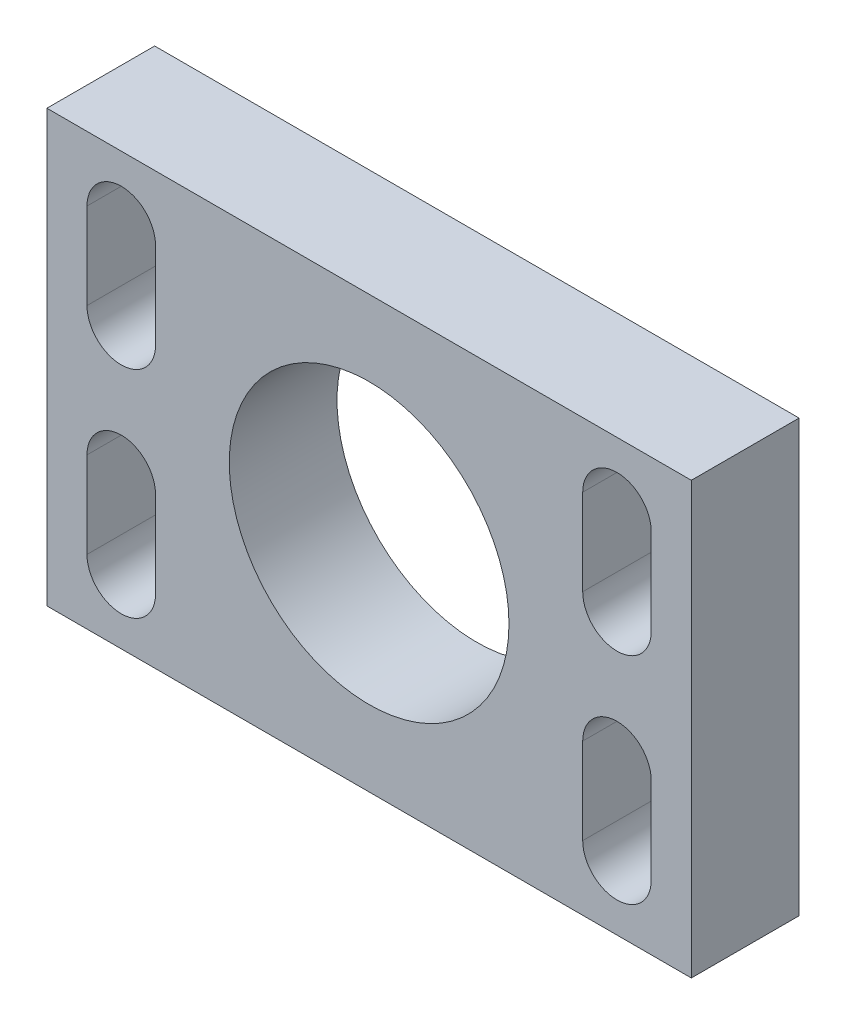
ISO-10303-21;
HEADER;
FILE_DESCRIPTION(('STEP AP214'),'2;1');
FILE_NAME('part.step','',(''),(''),'','','');
FILE_SCHEMA(('AUTOMOTIVE_DESIGN { 1 0 10303 214 1 1 1 1 }'));
ENDSEC;
DATA;
#1=APPLICATION_CONTEXT('core data for automotive mechanical design processes');
#2=APPLICATION_PROTOCOL_DEFINITION('international standard','automotive_design',2000,#1);
#3=PRODUCT_CONTEXT('',#1,'mechanical');
#4=PRODUCT('Part','Part','',(#3));
#5=PRODUCT_RELATED_PRODUCT_CATEGORY('part','',(#4));
#6=PRODUCT_DEFINITION_FORMATION('','',#4);
#7=PRODUCT_DEFINITION_CONTEXT('part definition',#1,'design');
#8=PRODUCT_DEFINITION('design','',#6,#7);
#9=PRODUCT_DEFINITION_SHAPE('','',#8);
#10=(LENGTH_UNIT() NAMED_UNIT(*) SI_UNIT(.MILLI.,.METRE.));
#11=(NAMED_UNIT(*) PLANE_ANGLE_UNIT() SI_UNIT($,.RADIAN.));
#12=(NAMED_UNIT(*) SI_UNIT($,.STERADIAN.) SOLID_ANGLE_UNIT());
#13=UNCERTAINTY_MEASURE_WITH_UNIT(LENGTH_MEASURE(1.E-05),#10,'distance_accuracy_value','');
#14=(GEOMETRIC_REPRESENTATION_CONTEXT(3) GLOBAL_UNCERTAINTY_ASSIGNED_CONTEXT((#13)) GLOBAL_UNIT_ASSIGNED_CONTEXT((#10,
#11,#12)) REPRESENTATION_CONTEXT('',''));
#15=CARTESIAN_POINT('',(0.,0.,0.));
#16=DIRECTION('',(0.,0.,1.));
#17=DIRECTION('',(1.,0.,0.));
#18=AXIS2_PLACEMENT_3D('',#15,#16,#17);
#19=CARTESIAN_POINT('',(-6.22137404580153,20.,1.56488549618321));
#20=DIRECTION('',(0.,0.,-1.));
#21=DIRECTION('',(-1.,0.,0.));
#22=AXIS2_PLACEMENT_3D('',#19,#20,#21);
#23=PLANE('',#22);
#24=CARTESIAN_POINT('',(-2.77137404580153,3.,1.56488549618321));
#25=DIRECTION('',(0.,0.,1.));
#26=DIRECTION('',(1.,0.,0.));
#27=AXIS2_PLACEMENT_3D('',#24,#25,#26);
#28=CIRCLE('',#27,1.59);
#29=CARTESIAN_POINT('',(-1.18137404580153,3.,1.56488549618321));
#30=VERTEX_POINT('',#29);
#31=CARTESIAN_POINT('',(-4.36137404580153,3.,1.56488549618321));
#32=VERTEX_POINT('',#31);
#33=EDGE_CURVE('E194',#30,#32,#28,.F.);
#34=ORIENTED_EDGE('',*,*,#33,.T.);
#35=DIRECTION('',(0.,-1.,0.));
#36=VECTOR('',#35,1.);
#37=CARTESIAN_POINT('',(-4.36137404580153,0.,1.56488549618321));
#38=LINE('',#37,#36);
#39=CARTESIAN_POINT('',(-4.36137404580153,7.,1.56488549618321));
#40=VERTEX_POINT('',#39);
#41=EDGE_CURVE('E195',#40,#32,#38,.T.);
#42=ORIENTED_EDGE('',*,*,#41,.F.);
#43=CARTESIAN_POINT('',(-2.77137404580153,7.,1.56488549618321));
#44=DIRECTION('',(0.,0.,1.));
#45=DIRECTION('',(1.,0.,0.));
#46=AXIS2_PLACEMENT_3D('',#43,#44,#45);
#47=CIRCLE('',#46,1.59);
#48=CARTESIAN_POINT('',(-1.18137404580153,7.,1.56488549618321));
#49=VERTEX_POINT('',#48);
#50=EDGE_CURVE('E209',#40,#49,#47,.F.);
#51=ORIENTED_EDGE('',*,*,#50,.T.);
#52=DIRECTION('',(0.,-1.,0.));
#53=VECTOR('',#52,1.);
#54=CARTESIAN_POINT('',(-1.18137404580153,0.,1.56488549618321));
#55=LINE('',#54,#53);
#56=EDGE_CURVE('E202',#49,#30,#55,.T.);
#57=ORIENTED_EDGE('',*,*,#56,.T.);
#58=EDGE_LOOP('',(#34,#42,#51,#57));
#59=FACE_BOUND('',#58,.T.);
#60=CARTESIAN_POINT('',(-2.77137404580153,17.,1.56488549618321));
#61=DIRECTION('',(0.,0.,1.));
#62=DIRECTION('',(1.,0.,0.));
#63=AXIS2_PLACEMENT_3D('',#60,#61,#62);
#64=CIRCLE('',#63,1.59);
#65=CARTESIAN_POINT('',(-1.18137404580153,17.,1.56488549618321));
#66=VERTEX_POINT('',#65);
#67=CARTESIAN_POINT('',(-4.36137404580153,17.,1.56488549618321));
#68=VERTEX_POINT('',#67);
#69=EDGE_CURVE('E287',#66,#68,#64,.T.);
#70=ORIENTED_EDGE('',*,*,#69,.F.);
#71=DIRECTION('',(0.,1.,0.));
#72=VECTOR('',#71,1.);
#73=CARTESIAN_POINT('',(-1.18137404580153,0.,1.56488549618321));
#74=LINE('',#73,#72);
#75=CARTESIAN_POINT('',(-1.18137404580153,13.,1.56488549618321));
#76=VERTEX_POINT('',#75);
#77=EDGE_CURVE('E285',#76,#66,#74,.T.);
#78=ORIENTED_EDGE('',*,*,#77,.F.);
#79=CARTESIAN_POINT('',(-2.77137404580153,13.,1.56488549618321));
#80=DIRECTION('',(0.,0.,1.));
#81=DIRECTION('',(1.,0.,0.));
#82=AXIS2_PLACEMENT_3D('',#79,#80,#81);
#83=CIRCLE('',#82,1.59);
#84=CARTESIAN_POINT('',(-4.36137404580153,13.,1.56488549618321));
#85=VERTEX_POINT('',#84);
#86=EDGE_CURVE('E293',#85,#76,#83,.T.);
#87=ORIENTED_EDGE('',*,*,#86,.F.);
#88=DIRECTION('',(0.,1.,0.));
#89=VECTOR('',#88,1.);
#90=CARTESIAN_POINT('',(-4.36137404580153,0.,1.56488549618321));
#91=LINE('',#90,#89);
#92=EDGE_CURVE('E290',#85,#68,#91,.T.);
#93=ORIENTED_EDGE('',*,*,#92,.T.);
#94=EDGE_LOOP('',(#70,#78,#87,#93));
#95=FACE_BOUND('',#94,.T.);
#96=CARTESIAN_POINT('',(8.72862595419847,10.,1.56488549618321));
#97=DIRECTION('',(0.,0.,1.));
#98=DIRECTION('',(1.,0.,0.));
#99=AXIS2_PLACEMENT_3D('',#96,#97,#98);
#100=CIRCLE('',#99,6.4897);
#101=CARTESIAN_POINT('',(15.2183259541985,10.,1.56488549618321));
#102=VERTEX_POINT('',#101);
#103=EDGE_CURVE('E308',#102,#102,#100,.T.);
#104=ORIENTED_EDGE('',*,*,#103,.F.);
#105=EDGE_LOOP('',(#104));
#106=FACE_BOUND('',#105,.T.);
#107=DIRECTION('',(1.,0.,0.));
#108=VECTOR('',#107,1.);
#109=CARTESIAN_POINT('',(-6.22137404580153,0.,1.56488549618321));
#110=LINE('',#109,#108);
#111=CARTESIAN_POINT('',(-6.22137404580153,0.,1.56488549618321));
#112=VERTEX_POINT('',#111);
#113=CARTESIAN_POINT('',(23.6786259541985,0.,1.56488549618321));
#114=VERTEX_POINT('',#113);
#115=EDGE_CURVE('E328',#112,#114,#110,.T.);
#116=ORIENTED_EDGE('',*,*,#115,.T.);
#117=DIRECTION('',(0.,-1.,0.));
#118=VECTOR('',#117,1.);
#119=CARTESIAN_POINT('',(23.6786259541985,20.,1.56488549618321));
#120=LINE('',#119,#118);
#121=CARTESIAN_POINT('',(23.6786259541985,20.,1.56488549618321));
#122=VERTEX_POINT('',#121);
#123=EDGE_CURVE('E45',#122,#114,#120,.T.);
#124=ORIENTED_EDGE('',*,*,#123,.F.);
#125=DIRECTION('',(1.,0.,0.));
#126=VECTOR('',#125,1.);
#127=CARTESIAN_POINT('',(-6.22137404580153,20.,1.56488549618321));
#128=LINE('',#127,#126);
#129=CARTESIAN_POINT('',(-6.22137404580153,20.,1.56488549618321));
#130=VERTEX_POINT('',#129);
#131=EDGE_CURVE('E318',#130,#122,#128,.T.);
#132=ORIENTED_EDGE('',*,*,#131,.F.);
#133=DIRECTION('',(0.,-1.,0.));
#134=VECTOR('',#133,1.);
#135=CARTESIAN_POINT('',(-6.22137404580153,20.,1.56488549618321));
#136=LINE('',#135,#134);
#137=EDGE_CURVE('E11',#130,#112,#136,.T.);
#138=ORIENTED_EDGE('',*,*,#137,.T.);
#139=EDGE_LOOP('',(#116,#124,#132,#138));
#140=FACE_BOUND('',#139,.T.);
#141=CARTESIAN_POINT('',(20.2286259541985,3.,1.56488549618321));
#142=DIRECTION('',(0.,0.,1.));
#143=DIRECTION('',(1.,0.,0.));
#144=AXIS2_PLACEMENT_3D('',#141,#142,#143);
#145=CIRCLE('',#144,1.59);
#146=CARTESIAN_POINT('',(18.6386259541985,3.,1.56488549618321));
#147=VERTEX_POINT('',#146);
#148=CARTESIAN_POINT('',(21.8186259541985,3.,1.56488549618321));
#149=VERTEX_POINT('',#148);
#150=EDGE_CURVE('E229',#147,#149,#145,.T.);
#151=ORIENTED_EDGE('',*,*,#150,.F.);
#152=DIRECTION('',(0.,-1.,0.));
#153=VECTOR('',#152,1.);
#154=CARTESIAN_POINT('',(18.6386259541985,0.,1.56488549618321));
#155=LINE('',#154,#153);
#156=CARTESIAN_POINT('',(18.6386259541985,7.,1.56488549618321));
#157=VERTEX_POINT('',#156);
#158=EDGE_CURVE('E60',#157,#147,#155,.T.);
#159=ORIENTED_EDGE('',*,*,#158,.F.);
#160=CARTESIAN_POINT('',(20.2286259541985,7.,1.56488549618321));
#161=DIRECTION('',(0.,0.,1.));
#162=DIRECTION('',(1.,0.,0.));
#163=AXIS2_PLACEMENT_3D('',#160,#161,#162);
#164=CIRCLE('',#163,1.59);
#165=CARTESIAN_POINT('',(21.8186259541985,7.,1.56488549618321));
#166=VERTEX_POINT('',#165);
#167=EDGE_CURVE('E235',#166,#157,#164,.T.);
#168=ORIENTED_EDGE('',*,*,#167,.F.);
#169=DIRECTION('',(0.,-1.,0.));
#170=VECTOR('',#169,1.);
#171=CARTESIAN_POINT('',(21.8186259541985,0.,1.56488549618321));
#172=LINE('',#171,#170);
#173=EDGE_CURVE('E232',#166,#149,#172,.T.);
#174=ORIENTED_EDGE('',*,*,#173,.T.);
#175=EDGE_LOOP('',(#151,#159,#168,#174));
#176=FACE_BOUND('',#175,.T.);
#177=CARTESIAN_POINT('',(20.2286259541985,17.,1.56488549618321));
#178=DIRECTION('',(0.,0.,1.));
#179=DIRECTION('',(1.,0.,0.));
#180=AXIS2_PLACEMENT_3D('',#177,#178,#179);
#181=CIRCLE('',#180,1.59);
#182=CARTESIAN_POINT('',(18.6386259541985,17.,1.56488549618321));
#183=VERTEX_POINT('',#182);
#184=CARTESIAN_POINT('',(21.8186259541985,17.,1.56488549618321));
#185=VERTEX_POINT('',#184);
#186=EDGE_CURVE('E52',#183,#185,#181,.F.);
#187=ORIENTED_EDGE('',*,*,#186,.T.);
#188=DIRECTION('',(0.,1.,0.));
#189=VECTOR('',#188,1.);
#190=CARTESIAN_POINT('',(21.8186259541985,0.,1.56488549618321));
#191=LINE('',#190,#189);
#192=CARTESIAN_POINT('',(21.8186259541985,13.,1.56488549618321));
#193=VERTEX_POINT('',#192);
#194=EDGE_CURVE('E264',#193,#185,#191,.T.);
#195=ORIENTED_EDGE('',*,*,#194,.F.);
#196=CARTESIAN_POINT('',(20.2286259541985,13.,1.56488549618321));
#197=DIRECTION('',(0.,0.,1.));
#198=DIRECTION('',(1.,0.,0.));
#199=AXIS2_PLACEMENT_3D('',#196,#197,#198);
#200=CIRCLE('',#199,1.59);
#201=CARTESIAN_POINT('',(18.6386259541985,13.,1.56488549618321));
#202=VERTEX_POINT('',#201);
#203=EDGE_CURVE('E261',#193,#202,#200,.F.);
#204=ORIENTED_EDGE('',*,*,#203,.T.);
#205=DIRECTION('',(0.,1.,0.));
#206=VECTOR('',#205,1.);
#207=CARTESIAN_POINT('',(18.6386259541985,0.,1.56488549618321));
#208=LINE('',#207,#206);
#209=EDGE_CURVE('E258',#202,#183,#208,.T.);
#210=ORIENTED_EDGE('',*,*,#209,.T.);
#211=EDGE_LOOP('',(#187,#195,#204,#210));
#212=FACE_BOUND('',#211,.T.);
#213=ADVANCED_FACE('F37',(#59,#95,#106,#140,#176,#212),#23,.F.);
#214=CARTESIAN_POINT('',(-6.22137404580153,20.,-3.43511450381679));
#215=DIRECTION('',(0.,0.,1.));
#216=DIRECTION('',(1.,0.,0.));
#217=AXIS2_PLACEMENT_3D('',#214,#215,#216);
#218=PLANE('',#217);
#219=CARTESIAN_POINT('',(-2.77137404580153,3.,-3.43511450381679));
#220=DIRECTION('',(0.,0.,1.));
#221=DIRECTION('',(1.,0.,0.));
#222=AXIS2_PLACEMENT_3D('',#219,#220,#221);
#223=CIRCLE('',#222,1.59);
#224=CARTESIAN_POINT('',(-4.36137404580153,3.,-3.43511450381679));
#225=VERTEX_POINT('',#224);
#226=CARTESIAN_POINT('',(-1.18137404580153,3.,-3.43511450381679));
#227=VERTEX_POINT('',#226);
#228=EDGE_CURVE('E191',#225,#227,#223,.T.);
#229=ORIENTED_EDGE('',*,*,#228,.T.);
#230=DIRECTION('',(0.,1.,0.));
#231=VECTOR('',#230,1.);
#232=CARTESIAN_POINT('',(-1.18137404580153,0.,-3.43511450381679));
#233=LINE('',#232,#231);
#234=CARTESIAN_POINT('',(-1.18137404580153,7.,-3.43511450381679));
#235=VERTEX_POINT('',#234);
#236=EDGE_CURVE('E175',#227,#235,#233,.T.);
#237=ORIENTED_EDGE('',*,*,#236,.T.);
#238=CARTESIAN_POINT('',(-2.77137404580153,7.,-3.43511450381679));
#239=DIRECTION('',(0.,0.,1.));
#240=DIRECTION('',(1.,0.,0.));
#241=AXIS2_PLACEMENT_3D('',#238,#239,#240);
#242=CIRCLE('',#241,1.59);
#243=CARTESIAN_POINT('',(-4.36137404580154,7.,-3.43511450381679));
#244=VERTEX_POINT('',#243);
#245=EDGE_CURVE('E204',#235,#244,#242,.T.);
#246=ORIENTED_EDGE('',*,*,#245,.T.);
#247=DIRECTION('',(0.,1.,0.));
#248=VECTOR('',#247,1.);
#249=CARTESIAN_POINT('',(-4.36137404580153,0.,-3.43511450381679));
#250=LINE('',#249,#248);
#251=EDGE_CURVE('E200',#225,#244,#250,.T.);
#252=ORIENTED_EDGE('',*,*,#251,.F.);
#253=EDGE_LOOP('',(#229,#237,#246,#252));
#254=FACE_BOUND('',#253,.T.);
#255=CARTESIAN_POINT('',(-2.77137404580153,13.,-3.43511450381679));
#256=DIRECTION('',(0.,0.,1.));
#257=DIRECTION('',(1.,0.,0.));
#258=AXIS2_PLACEMENT_3D('',#255,#256,#257);
#259=CIRCLE('',#258,1.59);
#260=CARTESIAN_POINT('',(-1.18137404580153,13.,-3.43511450381679));
#261=VERTEX_POINT('',#260);
#262=CARTESIAN_POINT('',(-4.36137404580153,13.,-3.43511450381679));
#263=VERTEX_POINT('',#262);
#264=EDGE_CURVE('E279',#261,#263,#259,.F.);
#265=ORIENTED_EDGE('',*,*,#264,.F.);
#266=DIRECTION('',(0.,-1.,0.));
#267=VECTOR('',#266,1.);
#268=CARTESIAN_POINT('',(-1.18137404580153,0.,-3.43511450381679));
#269=LINE('',#268,#267);
#270=CARTESIAN_POINT('',(-1.18137404580153,17.,-3.43511450381679));
#271=VERTEX_POINT('',#270);
#272=EDGE_CURVE('E282',#271,#261,#269,.T.);
#273=ORIENTED_EDGE('',*,*,#272,.F.);
#274=CARTESIAN_POINT('',(-2.77137404580153,17.,-3.43511450381679));
#275=DIRECTION('',(0.,0.,1.));
#276=DIRECTION('',(1.,0.,0.));
#277=AXIS2_PLACEMENT_3D('',#274,#275,#276);
#278=CIRCLE('',#277,1.59);
#279=CARTESIAN_POINT('',(-4.36137404580154,17.,-3.43511450381679));
#280=VERTEX_POINT('',#279);
#281=EDGE_CURVE('E299',#280,#271,#278,.F.);
#282=ORIENTED_EDGE('',*,*,#281,.F.);
#283=DIRECTION('',(0.,-1.,0.));
#284=VECTOR('',#283,1.);
#285=CARTESIAN_POINT('',(-4.36137404580153,0.,-3.43511450381679));
#286=LINE('',#285,#284);
#287=EDGE_CURVE('E186',#280,#263,#286,.T.);
#288=ORIENTED_EDGE('',*,*,#287,.T.);
#289=EDGE_LOOP('',(#265,#273,#282,#288));
#290=FACE_BOUND('',#289,.T.);
#291=CARTESIAN_POINT('',(8.72862595419847,10.,-3.43511450381679));
#292=DIRECTION('',(0.,0.,1.));
#293=DIRECTION('',(1.,0.,0.));
#294=AXIS2_PLACEMENT_3D('',#291,#292,#293);
#295=CIRCLE('',#294,6.4897);
#296=CARTESIAN_POINT('',(15.2183259541985,10.,-3.43511450381679));
#297=VERTEX_POINT('',#296);
#298=EDGE_CURVE('E311',#297,#297,#295,.F.);
#299=ORIENTED_EDGE('',*,*,#298,.F.);
#300=EDGE_LOOP('',(#299));
#301=FACE_BOUND('',#300,.T.);
#302=DIRECTION('',(-1.,0.,0.));
#303=VECTOR('',#302,1.);
#304=CARTESIAN_POINT('',(-6.22137404580153,0.,-3.43511450381679));
#305=LINE('',#304,#303);
#306=CARTESIAN_POINT('',(23.6786259541985,0.,-3.43511450381679));
#307=VERTEX_POINT('',#306);
#308=CARTESIAN_POINT('',(-6.22137404580153,0.,-3.43511450381679));
#309=VERTEX_POINT('',#308);
#310=EDGE_CURVE('E319',#307,#309,#305,.T.);
#311=ORIENTED_EDGE('',*,*,#310,.T.);
#312=DIRECTION('',(0.,-1.,0.));
#313=VECTOR('',#312,1.);
#314=CARTESIAN_POINT('',(-6.22137404580153,20.,-3.43511450381679));
#315=LINE('',#314,#313);
#316=CARTESIAN_POINT('',(-6.22137404580153,20.,-3.43511450381679));
#317=VERTEX_POINT('',#316);
#318=EDGE_CURVE('E325',#317,#309,#315,.T.);
#319=ORIENTED_EDGE('',*,*,#318,.F.);
#320=DIRECTION('',(-1.,0.,0.));
#321=VECTOR('',#320,1.);
#322=CARTESIAN_POINT('',(-6.22137404580153,20.,-3.43511450381679));
#323=LINE('',#322,#321);
#324=CARTESIAN_POINT('',(23.6786259541985,20.,-3.43511450381679));
#325=VERTEX_POINT('',#324);
#326=EDGE_CURVE('E323',#325,#317,#323,.T.);
#327=ORIENTED_EDGE('',*,*,#326,.F.);
#328=DIRECTION('',(0.,-1.,0.));
#329=VECTOR('',#328,1.);
#330=CARTESIAN_POINT('',(23.6786259541985,20.,-3.43511450381679));
#331=LINE('',#330,#329);
#332=EDGE_CURVE('E335',#325,#307,#331,.T.);
#333=ORIENTED_EDGE('',*,*,#332,.T.);
#334=EDGE_LOOP('',(#311,#319,#327,#333));
#335=FACE_BOUND('',#334,.T.);
#336=CARTESIAN_POINT('',(20.2286259541985,7.,-3.43511450381679));
#337=DIRECTION('',(0.,0.,1.));
#338=DIRECTION('',(1.,0.,0.));
#339=AXIS2_PLACEMENT_3D('',#336,#337,#338);
#340=CIRCLE('',#339,1.59);
#341=CARTESIAN_POINT('',(18.6386259541985,7.,-3.43511450381679));
#342=VERTEX_POINT('',#341);
#343=CARTESIAN_POINT('',(21.8186259541985,7.,-3.43511450381679));
#344=VERTEX_POINT('',#343);
#345=EDGE_CURVE('E221',#342,#344,#340,.F.);
#346=ORIENTED_EDGE('',*,*,#345,.F.);
#347=DIRECTION('',(0.,1.,0.));
#348=VECTOR('',#347,1.);
#349=CARTESIAN_POINT('',(18.6386259541985,0.,-3.43511450381679));
#350=LINE('',#349,#348);
#351=CARTESIAN_POINT('',(18.6386259541985,3.,-3.43511450381679));
#352=VERTEX_POINT('',#351);
#353=EDGE_CURVE('E225',#352,#342,#350,.T.);
#354=ORIENTED_EDGE('',*,*,#353,.F.);
#355=CARTESIAN_POINT('',(20.2286259541985,3.,-3.43511450381679));
#356=DIRECTION('',(0.,0.,1.));
#357=DIRECTION('',(1.,0.,0.));
#358=AXIS2_PLACEMENT_3D('',#355,#356,#357);
#359=CIRCLE('',#358,1.59);
#360=CARTESIAN_POINT('',(21.8186259541985,3.,-3.43511450381679));
#361=VERTEX_POINT('',#360);
#362=EDGE_CURVE('E241',#361,#352,#359,.F.);
#363=ORIENTED_EDGE('',*,*,#362,.F.);
#364=DIRECTION('',(0.,1.,0.));
#365=VECTOR('',#364,1.);
#366=CARTESIAN_POINT('',(21.8186259541985,0.,-3.43511450381679));
#367=LINE('',#366,#365);
#368=EDGE_CURVE('E218',#361,#344,#367,.T.);
#369=ORIENTED_EDGE('',*,*,#368,.T.);
#370=EDGE_LOOP('',(#346,#354,#363,#369));
#371=FACE_BOUND('',#370,.T.);
#372=CARTESIAN_POINT('',(20.2286259541985,17.,-3.43511450381679));
#373=DIRECTION('',(0.,0.,1.));
#374=DIRECTION('',(1.,0.,0.));
#375=AXIS2_PLACEMENT_3D('',#372,#373,#374);
#376=CIRCLE('',#375,1.59);
#377=CARTESIAN_POINT('',(21.8186259541985,17.,-3.43511450381679));
#378=VERTEX_POINT('',#377);
#379=CARTESIAN_POINT('',(18.6386259541985,17.,-3.43511450381679));
#380=VERTEX_POINT('',#379);
#381=EDGE_CURVE('E254',#378,#380,#376,.T.);
#382=ORIENTED_EDGE('',*,*,#381,.T.);
#383=DIRECTION('',(0.,-1.,0.));
#384=VECTOR('',#383,1.);
#385=CARTESIAN_POINT('',(18.6386259541985,0.,-3.43511450381679));
#386=LINE('',#385,#384);
#387=CARTESIAN_POINT('',(18.6386259541985,13.,-3.43511450381679));
#388=VERTEX_POINT('',#387);
#389=EDGE_CURVE('E222',#380,#388,#386,.T.);
#390=ORIENTED_EDGE('',*,*,#389,.T.);
#391=CARTESIAN_POINT('',(20.2286259541985,13.,-3.43511450381679));
#392=DIRECTION('',(0.,0.,1.));
#393=DIRECTION('',(1.,0.,0.));
#394=AXIS2_PLACEMENT_3D('',#391,#392,#393);
#395=CIRCLE('',#394,1.59);
#396=CARTESIAN_POINT('',(21.8186259541985,13.,-3.43511450381679));
#397=VERTEX_POINT('',#396);
#398=EDGE_CURVE('E249',#388,#397,#395,.T.);
#399=ORIENTED_EDGE('',*,*,#398,.T.);
#400=DIRECTION('',(0.,-1.,0.));
#401=VECTOR('',#400,1.);
#402=CARTESIAN_POINT('',(21.8186259541985,0.,-3.43511450381679));
#403=LINE('',#402,#401);
#404=EDGE_CURVE('E252',#378,#397,#403,.T.);
#405=ORIENTED_EDGE('',*,*,#404,.F.);
#406=EDGE_LOOP('',(#382,#390,#399,#405));
#407=FACE_BOUND('',#406,.T.);
#408=ADVANCED_FACE('F198',(#254,#290,#301,#335,#371,#407),#218,.F.);
#409=CARTESIAN_POINT('',(-6.22137404580153,20.,-3.43511450381679));
#410=DIRECTION('',(1.,0.,0.));
#411=DIRECTION('',(0.,0.,-1.));
#412=AXIS2_PLACEMENT_3D('',#409,#410,#411);
#413=PLANE('',#412);
#414=DIRECTION('',(0.,0.,1.));
#415=VECTOR('',#414,1.);
#416=CARTESIAN_POINT('',(-6.22137404580153,0.,-3.43511450381679));
#417=LINE('',#416,#415);
#418=EDGE_CURVE('E314',#309,#112,#417,.T.);
#419=ORIENTED_EDGE('',*,*,#418,.T.);
#420=ORIENTED_EDGE('',*,*,#137,.F.);
#421=DIRECTION('',(0.,0.,1.));
#422=VECTOR('',#421,1.);
#423=CARTESIAN_POINT('',(-6.22137404580153,20.,-3.43511450381679));
#424=LINE('',#423,#422);
#425=EDGE_CURVE('E315',#317,#130,#424,.T.);
#426=ORIENTED_EDGE('',*,*,#425,.F.);
#427=ORIENTED_EDGE('',*,*,#318,.T.);
#428=EDGE_LOOP('',(#419,#420,#426,#427));
#429=FACE_BOUND('',#428,.T.);
#430=ADVANCED_FACE('F39',(#429),#413,.F.);
#431=CARTESIAN_POINT('',(23.6786259541985,20.,-3.43511450381679));
#432=DIRECTION('',(-1.,0.,0.));
#433=DIRECTION('',(0.,0.,1.));
#434=AXIS2_PLACEMENT_3D('',#431,#432,#433);
#435=PLANE('',#434);
#436=DIRECTION('',(0.,0.,-1.));
#437=VECTOR('',#436,1.);
#438=CARTESIAN_POINT('',(23.6786259541985,0.,-3.43511450381679));
#439=LINE('',#438,#437);
#440=EDGE_CURVE('E330',#114,#307,#439,.T.);
#441=ORIENTED_EDGE('',*,*,#440,.T.);
#442=ORIENTED_EDGE('',*,*,#332,.F.);
#443=DIRECTION('',(0.,0.,-1.));
#444=VECTOR('',#443,1.);
#445=CARTESIAN_POINT('',(23.6786259541985,20.,-3.43511450381679));
#446=LINE('',#445,#444);
#447=EDGE_CURVE('E321',#122,#325,#446,.T.);
#448=ORIENTED_EDGE('',*,*,#447,.F.);
#449=ORIENTED_EDGE('',*,*,#123,.T.);
#450=EDGE_LOOP('',(#441,#442,#448,#449));
#451=FACE_BOUND('',#450,.T.);
#452=ADVANCED_FACE('F342',(#451),#435,.F.);
#453=CARTESIAN_POINT('',(0.,20.,0.));
#454=DIRECTION('',(0.,1.,0.));
#455=DIRECTION('',(0.,0.,1.));
#456=AXIS2_PLACEMENT_3D('',#453,#454,#455);
#457=PLANE('',#456);
#458=ORIENTED_EDGE('',*,*,#425,.T.);
#459=ORIENTED_EDGE('',*,*,#131,.T.);
#460=ORIENTED_EDGE('',*,*,#447,.T.);
#461=ORIENTED_EDGE('',*,*,#326,.T.);
#462=EDGE_LOOP('',(#458,#459,#460,#461));
#463=FACE_BOUND('',#462,.T.);
#464=ADVANCED_FACE('F357',(#463),#457,.T.);
#465=CARTESIAN_POINT('',(0.,0.,0.));
#466=DIRECTION('',(0.,1.,0.));
#467=DIRECTION('',(0.,0.,1.));
#468=AXIS2_PLACEMENT_3D('',#465,#466,#467);
#469=PLANE('',#468);
#470=ORIENTED_EDGE('',*,*,#418,.F.);
#471=ORIENTED_EDGE('',*,*,#310,.F.);
#472=ORIENTED_EDGE('',*,*,#440,.F.);
#473=ORIENTED_EDGE('',*,*,#115,.F.);
#474=EDGE_LOOP('',(#470,#471,#472,#473));
#475=FACE_BOUND('',#474,.T.);
#476=ADVANCED_FACE('F348',(#475),#469,.F.);
#477=CARTESIAN_POINT('',(8.72862595419847,10.,-3.43611450381679));
#478=DIRECTION('',(0.,0.,1.));
#479=DIRECTION('',(1.,0.,0.));
#480=AXIS2_PLACEMENT_3D('',#477,#478,#479);
#481=CYLINDRICAL_SURFACE('',#480,6.4897);
#482=ORIENTED_EDGE('',*,*,#103,.T.);
#483=EDGE_LOOP('',(#482));
#484=FACE_BOUND('',#483,.T.);
#485=ORIENTED_EDGE('',*,*,#298,.T.);
#486=EDGE_LOOP('',(#485));
#487=FACE_BOUND('',#486,.T.);
#488=ADVANCED_FACE('F406',(#484,#487),#481,.F.);
#489=CARTESIAN_POINT('',(-1.18137404580153,0.,-3.43611450381679));
#490=DIRECTION('',(1.,0.,0.));
#491=DIRECTION('',(0.,0.,-1.));
#492=AXIS2_PLACEMENT_3D('',#489,#490,#491);
#493=PLANE('',#492);
#494=ORIENTED_EDGE('',*,*,#272,.T.);
#495=DIRECTION('',(0.,0.,1.));
#496=VECTOR('',#495,1.);
#497=CARTESIAN_POINT('',(-1.18137404580153,13.,-3.43611450381679));
#498=LINE('',#497,#496);
#499=EDGE_CURVE('E297',#261,#76,#498,.T.);
#500=ORIENTED_EDGE('',*,*,#499,.T.);
#501=ORIENTED_EDGE('',*,*,#77,.T.);
#502=DIRECTION('',(0.,0.,1.));
#503=VECTOR('',#502,1.);
#504=CARTESIAN_POINT('',(-1.18137404580153,17.,-3.43611450381679));
#505=LINE('',#504,#503);
#506=EDGE_CURVE('E296',#271,#66,#505,.T.);
#507=ORIENTED_EDGE('',*,*,#506,.F.);
#508=EDGE_LOOP('',(#494,#500,#501,#507));
#509=FACE_BOUND('',#508,.T.);
#510=ADVANCED_FACE('F395',(#509),#493,.F.);
#511=CARTESIAN_POINT('',(-2.77137404580153,13.,-3.43611450381679));
#512=DIRECTION('',(0.,0.,1.));
#513=DIRECTION('',(1.,0.,0.));
#514=AXIS2_PLACEMENT_3D('',#511,#512,#513);
#515=CYLINDRICAL_SURFACE('',#514,1.59);
#516=ORIENTED_EDGE('',*,*,#264,.T.);
#517=DIRECTION('',(0.,0.,1.));
#518=VECTOR('',#517,1.);
#519=CARTESIAN_POINT('',(-4.36137404580153,13.,-3.43611450381679));
#520=LINE('',#519,#518);
#521=EDGE_CURVE('E300',#263,#85,#520,.T.);
#522=ORIENTED_EDGE('',*,*,#521,.T.);
#523=ORIENTED_EDGE('',*,*,#86,.T.);
#524=ORIENTED_EDGE('',*,*,#499,.F.);
#525=EDGE_LOOP('',(#516,#522,#523,#524));
#526=FACE_BOUND('',#525,.T.);
#527=ADVANCED_FACE('F391',(#526),#515,.F.);
#528=CARTESIAN_POINT('',(-4.36137404580153,0.,-3.43611450381679));
#529=DIRECTION('',(1.,0.,0.));
#530=DIRECTION('',(0.,0.,-1.));
#531=AXIS2_PLACEMENT_3D('',#528,#529,#530);
#532=PLANE('',#531);
#533=DIRECTION('',(0.,0.,1.));
#534=VECTOR('',#533,1.);
#535=CARTESIAN_POINT('',(-4.36137404580153,17.,-3.43611450381679));
#536=LINE('',#535,#534);
#537=EDGE_CURVE('E302',#280,#68,#536,.T.);
#538=ORIENTED_EDGE('',*,*,#537,.T.);
#539=ORIENTED_EDGE('',*,*,#92,.F.);
#540=ORIENTED_EDGE('',*,*,#521,.F.);
#541=ORIENTED_EDGE('',*,*,#287,.F.);
#542=EDGE_LOOP('',(#538,#539,#540,#541));
#543=FACE_BOUND('',#542,.T.);
#544=ADVANCED_FACE('F394',(#543),#532,.T.);
#545=CARTESIAN_POINT('',(-2.77137404580153,17.,-3.43611450381679));
#546=DIRECTION('',(0.,0.,1.));
#547=DIRECTION('',(1.,0.,0.));
#548=AXIS2_PLACEMENT_3D('',#545,#546,#547);
#549=CYLINDRICAL_SURFACE('',#548,1.59);
#550=ORIENTED_EDGE('',*,*,#281,.T.);
#551=ORIENTED_EDGE('',*,*,#506,.T.);
#552=ORIENTED_EDGE('',*,*,#69,.T.);
#553=ORIENTED_EDGE('',*,*,#537,.F.);
#554=EDGE_LOOP('',(#550,#551,#552,#553));
#555=FACE_BOUND('',#554,.T.);
#556=ADVANCED_FACE('F399',(#555),#549,.F.);
#557=CARTESIAN_POINT('',(-2.77137404580153,3.,-3.43611450381679));
#558=DIRECTION('',(0.,0.,1.));
#559=DIRECTION('',(1.,0.,0.));
#560=AXIS2_PLACEMENT_3D('',#557,#558,#559);
#561=CYLINDRICAL_SURFACE('',#560,1.59);
#562=DIRECTION('',(0.,0.,1.));
#563=VECTOR('',#562,1.);
#564=CARTESIAN_POINT('',(-4.36137404580153,3.,-3.43611450381679));
#565=LINE('',#564,#563);
#566=EDGE_CURVE('E187',#225,#32,#565,.T.);
#567=ORIENTED_EDGE('',*,*,#566,.T.);
#568=ORIENTED_EDGE('',*,*,#33,.F.);
#569=DIRECTION('',(0.,0.,1.));
#570=VECTOR('',#569,1.);
#571=CARTESIAN_POINT('',(-1.18137404580153,3.,-3.43611450381679));
#572=LINE('',#571,#570);
#573=EDGE_CURVE('E179',#227,#30,#572,.T.);
#574=ORIENTED_EDGE('',*,*,#573,.F.);
#575=ORIENTED_EDGE('',*,*,#228,.F.);
#576=EDGE_LOOP('',(#567,#568,#574,#575));
#577=FACE_BOUND('',#576,.T.);
#578=ADVANCED_FACE('F190',(#577),#561,.F.);
#579=CARTESIAN_POINT('',(-4.36137404580153,0.,-3.43611450381679));
#580=DIRECTION('',(-1.,0.,0.));
#581=DIRECTION('',(0.,0.,1.));
#582=AXIS2_PLACEMENT_3D('',#579,#580,#581);
#583=PLANE('',#582);
#584=ORIENTED_EDGE('',*,*,#251,.T.);
#585=DIRECTION('',(0.,0.,1.));
#586=VECTOR('',#585,1.);
#587=CARTESIAN_POINT('',(-4.36137404580153,7.,-3.43611450381679));
#588=LINE('',#587,#586);
#589=EDGE_CURVE('E215',#244,#40,#588,.T.);
#590=ORIENTED_EDGE('',*,*,#589,.T.);
#591=ORIENTED_EDGE('',*,*,#41,.T.);
#592=ORIENTED_EDGE('',*,*,#566,.F.);
#593=EDGE_LOOP('',(#584,#590,#591,#592));
#594=FACE_BOUND('',#593,.T.);
#595=ADVANCED_FACE('F479',(#594),#583,.F.);
#596=CARTESIAN_POINT('',(-2.77137404580153,7.,-3.43611450381679));
#597=DIRECTION('',(0.,0.,1.));
#598=DIRECTION('',(1.,0.,0.));
#599=AXIS2_PLACEMENT_3D('',#596,#597,#598);
#600=CYLINDRICAL_SURFACE('',#599,1.59);
#601=DIRECTION('',(0.,0.,1.));
#602=VECTOR('',#601,1.);
#603=CARTESIAN_POINT('',(-1.18137404580153,7.,-3.43611450381679));
#604=LINE('',#603,#602);
#605=EDGE_CURVE('E181',#235,#49,#604,.T.);
#606=ORIENTED_EDGE('',*,*,#605,.T.);
#607=ORIENTED_EDGE('',*,*,#50,.F.);
#608=ORIENTED_EDGE('',*,*,#589,.F.);
#609=ORIENTED_EDGE('',*,*,#245,.F.);
#610=EDGE_LOOP('',(#606,#607,#608,#609));
#611=FACE_BOUND('',#610,.T.);
#612=ADVANCED_FACE('F486',(#611),#600,.F.);
#613=CARTESIAN_POINT('',(-1.18137404580153,0.,-3.43611450381679));
#614=DIRECTION('',(-1.,0.,0.));
#615=DIRECTION('',(0.,0.,1.));
#616=AXIS2_PLACEMENT_3D('',#613,#614,#615);
#617=PLANE('',#616);
#618=ORIENTED_EDGE('',*,*,#573,.T.);
#619=ORIENTED_EDGE('',*,*,#56,.F.);
#620=ORIENTED_EDGE('',*,*,#605,.F.);
#621=ORIENTED_EDGE('',*,*,#236,.F.);
#622=EDGE_LOOP('',(#618,#619,#620,#621));
#623=FACE_BOUND('',#622,.T.);
#624=ADVANCED_FACE('F177',(#623),#617,.T.);
#625=CARTESIAN_POINT('',(18.6386259541985,0.,-3.43611450381679));
#626=DIRECTION('',(-1.,0.,0.));
#627=DIRECTION('',(0.,0.,1.));
#628=AXIS2_PLACEMENT_3D('',#625,#626,#627);
#629=PLANE('',#628);
#630=ORIENTED_EDGE('',*,*,#353,.T.);
#631=DIRECTION('',(0.,0.,1.));
#632=VECTOR('',#631,1.);
#633=CARTESIAN_POINT('',(18.6386259541985,7.,-3.43611450381679));
#634=LINE('',#633,#632);
#635=EDGE_CURVE('E239',#342,#157,#634,.T.);
#636=ORIENTED_EDGE('',*,*,#635,.T.);
#637=ORIENTED_EDGE('',*,*,#158,.T.);
#638=DIRECTION('',(0.,0.,1.));
#639=VECTOR('',#638,1.);
#640=CARTESIAN_POINT('',(18.6386259541985,3.,-3.43611450381679));
#641=LINE('',#640,#639);
#642=EDGE_CURVE('E238',#352,#147,#641,.T.);
#643=ORIENTED_EDGE('',*,*,#642,.F.);
#644=EDGE_LOOP('',(#630,#636,#637,#643));
#645=FACE_BOUND('',#644,.T.);
#646=ADVANCED_FACE('F501',(#645),#629,.F.);
#647=CARTESIAN_POINT('',(20.2286259541985,7.,-3.43611450381679));
#648=DIRECTION('',(0.,0.,1.));
#649=DIRECTION('',(1.,0.,0.));
#650=AXIS2_PLACEMENT_3D('',#647,#648,#649);
#651=CYLINDRICAL_SURFACE('',#650,1.59);
#652=ORIENTED_EDGE('',*,*,#345,.T.);
#653=DIRECTION('',(0.,0.,1.));
#654=VECTOR('',#653,1.);
#655=CARTESIAN_POINT('',(21.8186259541985,7.,-3.43611450381679));
#656=LINE('',#655,#654);
#657=EDGE_CURVE('E242',#344,#166,#656,.T.);
#658=ORIENTED_EDGE('',*,*,#657,.T.);
#659=ORIENTED_EDGE('',*,*,#167,.T.);
#660=ORIENTED_EDGE('',*,*,#635,.F.);
#661=EDGE_LOOP('',(#652,#658,#659,#660));
#662=FACE_BOUND('',#661,.T.);
#663=ADVANCED_FACE('F508',(#662),#651,.F.);
#664=CARTESIAN_POINT('',(21.8186259541985,0.,-3.43611450381679));
#665=DIRECTION('',(-1.,0.,0.));
#666=DIRECTION('',(0.,0.,1.));
#667=AXIS2_PLACEMENT_3D('',#664,#665,#666);
#668=PLANE('',#667);
#669=DIRECTION('',(0.,0.,1.));
#670=VECTOR('',#669,1.);
#671=CARTESIAN_POINT('',(21.8186259541985,3.,-3.43611450381679));
#672=LINE('',#671,#670);
#673=EDGE_CURVE('E244',#361,#149,#672,.T.);
#674=ORIENTED_EDGE('',*,*,#673,.T.);
#675=ORIENTED_EDGE('',*,*,#173,.F.);
#676=ORIENTED_EDGE('',*,*,#657,.F.);
#677=ORIENTED_EDGE('',*,*,#368,.F.);
#678=EDGE_LOOP('',(#674,#675,#676,#677));
#679=FACE_BOUND('',#678,.T.);
#680=ADVANCED_FACE('F514',(#679),#668,.T.);
#681=CARTESIAN_POINT('',(20.2286259541985,3.,-3.43611450381679));
#682=DIRECTION('',(0.,0.,1.));
#683=DIRECTION('',(1.,0.,0.));
#684=AXIS2_PLACEMENT_3D('',#681,#682,#683);
#685=CYLINDRICAL_SURFACE('',#684,1.59);
#686=ORIENTED_EDGE('',*,*,#362,.T.);
#687=ORIENTED_EDGE('',*,*,#642,.T.);
#688=ORIENTED_EDGE('',*,*,#150,.T.);
#689=ORIENTED_EDGE('',*,*,#673,.F.);
#690=EDGE_LOOP('',(#686,#687,#688,#689));
#691=FACE_BOUND('',#690,.T.);
#692=ADVANCED_FACE('F390',(#691),#685,.F.);
#693=CARTESIAN_POINT('',(20.2286259541985,17.,-3.43611450381679));
#694=DIRECTION('',(0.,0.,1.));
#695=DIRECTION('',(1.,0.,0.));
#696=AXIS2_PLACEMENT_3D('',#693,#694,#695);
#697=CYLINDRICAL_SURFACE('',#696,1.59);
#698=DIRECTION('',(0.,0.,1.));
#699=VECTOR('',#698,1.);
#700=CARTESIAN_POINT('',(21.8186259541985,17.,-3.43611450381679));
#701=LINE('',#700,#699);
#702=EDGE_CURVE('E268',#378,#185,#701,.T.);
#703=ORIENTED_EDGE('',*,*,#702,.T.);
#704=ORIENTED_EDGE('',*,*,#186,.F.);
#705=DIRECTION('',(0.,0.,1.));
#706=VECTOR('',#705,1.);
#707=CARTESIAN_POINT('',(18.6386259541985,17.,-3.43611450381679));
#708=LINE('',#707,#706);
#709=EDGE_CURVE('E267',#380,#183,#708,.T.);
#710=ORIENTED_EDGE('',*,*,#709,.F.);
#711=ORIENTED_EDGE('',*,*,#381,.F.);
#712=EDGE_LOOP('',(#703,#704,#710,#711));
#713=FACE_BOUND('',#712,.T.);
#714=ADVANCED_FACE('F369',(#713),#697,.F.);
#715=CARTESIAN_POINT('',(21.8186259541985,0.,-3.43611450381679));
#716=DIRECTION('',(1.,0.,0.));
#717=DIRECTION('',(0.,0.,-1.));
#718=AXIS2_PLACEMENT_3D('',#715,#716,#717);
#719=PLANE('',#718);
#720=ORIENTED_EDGE('',*,*,#404,.T.);
#721=DIRECTION('',(0.,0.,1.));
#722=VECTOR('',#721,1.);
#723=CARTESIAN_POINT('',(21.8186259541985,13.,-3.43611450381679));
#724=LINE('',#723,#722);
#725=EDGE_CURVE('E270',#397,#193,#724,.T.);
#726=ORIENTED_EDGE('',*,*,#725,.T.);
#727=ORIENTED_EDGE('',*,*,#194,.T.);
#728=ORIENTED_EDGE('',*,*,#702,.F.);
#729=EDGE_LOOP('',(#720,#726,#727,#728));
#730=FACE_BOUND('',#729,.T.);
#731=ADVANCED_FACE('F375',(#730),#719,.F.);
#732=CARTESIAN_POINT('',(20.2286259541985,13.,-3.43611450381679));
#733=DIRECTION('',(0.,0.,1.));
#734=DIRECTION('',(1.,0.,0.));
#735=AXIS2_PLACEMENT_3D('',#732,#733,#734);
#736=CYLINDRICAL_SURFACE('',#735,1.59);
#737=DIRECTION('',(0.,0.,1.));
#738=VECTOR('',#737,1.);
#739=CARTESIAN_POINT('',(18.6386259541985,13.,-3.43611450381679));
#740=LINE('',#739,#738);
#741=EDGE_CURVE('E272',#388,#202,#740,.T.);
#742=ORIENTED_EDGE('',*,*,#741,.T.);
#743=ORIENTED_EDGE('',*,*,#203,.F.);
#744=ORIENTED_EDGE('',*,*,#725,.F.);
#745=ORIENTED_EDGE('',*,*,#398,.F.);
#746=EDGE_LOOP('',(#742,#743,#744,#745));
#747=FACE_BOUND('',#746,.T.);
#748=ADVANCED_FACE('F377',(#747),#736,.F.);
#749=CARTESIAN_POINT('',(18.6386259541985,0.,-3.43611450381679));
#750=DIRECTION('',(1.,0.,0.));
#751=DIRECTION('',(0.,0.,-1.));
#752=AXIS2_PLACEMENT_3D('',#749,#750,#751);
#753=PLANE('',#752);
#754=ORIENTED_EDGE('',*,*,#709,.T.);
#755=ORIENTED_EDGE('',*,*,#209,.F.);
#756=ORIENTED_EDGE('',*,*,#741,.F.);
#757=ORIENTED_EDGE('',*,*,#389,.F.);
#758=EDGE_LOOP('',(#754,#755,#756,#757));
#759=FACE_BOUND('',#758,.T.);
#760=ADVANCED_FACE('F367',(#759),#753,.T.);
#761=CLOSED_SHELL('',(#213,#408,#430,#452,#464,#476,#488,#510,#527,#544,#556,#578,#595,#612,
#624,#646,#663,#680,#692,#714,#731,#748,#760));
#762=MANIFOLD_SOLID_BREP('B2',#761);
#763=ADVANCED_BREP_SHAPE_REPRESENTATION('',(#18,#762),#14);
#764=SHAPE_DEFINITION_REPRESENTATION(#9,#763);
ENDSEC;
END-ISO-10303-21;
